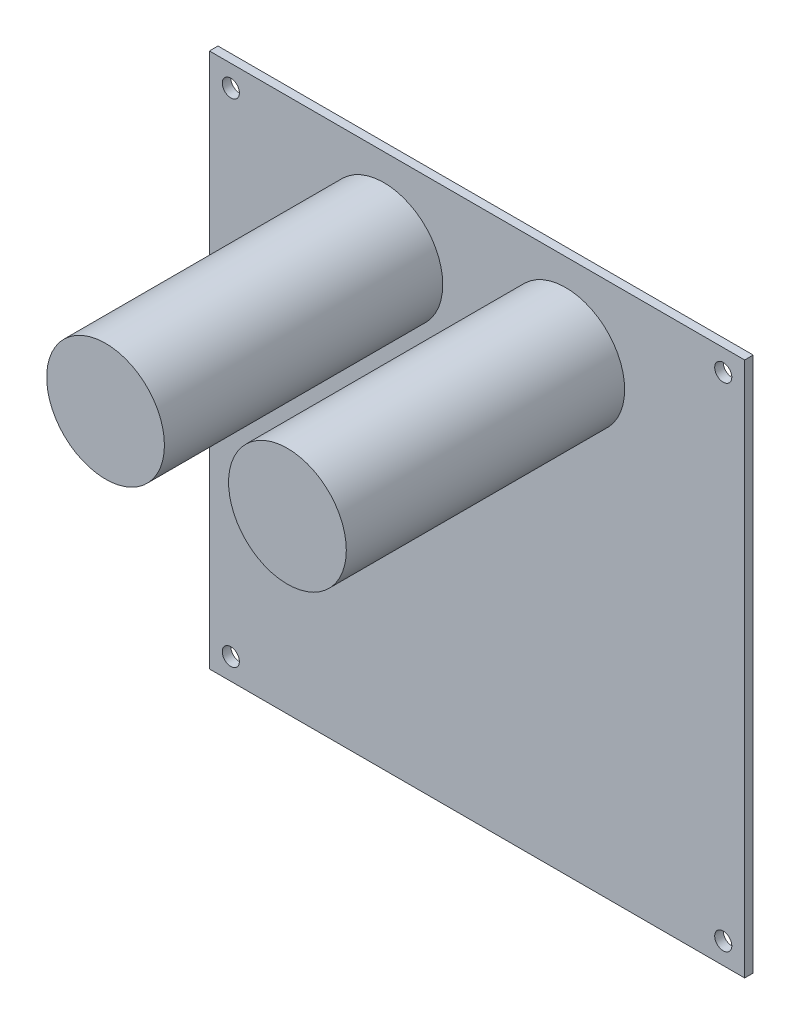
ISO-10303-21;
HEADER;
FILE_DESCRIPTION(('STEP AP214'),'2;1');
FILE_NAME('part.step','',(''),(''),'','','');
FILE_SCHEMA(('AUTOMOTIVE_DESIGN { 1 0 10303 214 1 1 1 1 }'));
ENDSEC;
DATA;
#1=APPLICATION_CONTEXT('core data for automotive mechanical design processes');
#2=APPLICATION_PROTOCOL_DEFINITION('international standard','automotive_design',2000,#1);
#3=PRODUCT_CONTEXT('',#1,'mechanical');
#4=PRODUCT('Part','Part','',(#3));
#5=PRODUCT_RELATED_PRODUCT_CATEGORY('part','',(#4));
#6=PRODUCT_DEFINITION_FORMATION('','',#4);
#7=PRODUCT_DEFINITION_CONTEXT('part definition',#1,'design');
#8=PRODUCT_DEFINITION('design','',#6,#7);
#9=PRODUCT_DEFINITION_SHAPE('','',#8);
#10=(LENGTH_UNIT() NAMED_UNIT(*) SI_UNIT(.MILLI.,.METRE.));
#11=(NAMED_UNIT(*) PLANE_ANGLE_UNIT() SI_UNIT($,.RADIAN.));
#12=(NAMED_UNIT(*) SI_UNIT($,.STERADIAN.) SOLID_ANGLE_UNIT());
#13=UNCERTAINTY_MEASURE_WITH_UNIT(LENGTH_MEASURE(1.E-05),#10,'distance_accuracy_value','');
#14=(GEOMETRIC_REPRESENTATION_CONTEXT(3) GLOBAL_UNCERTAINTY_ASSIGNED_CONTEXT((#13)) GLOBAL_UNIT_ASSIGNED_CONTEXT((#10,
#11,#12)) REPRESENTATION_CONTEXT('',''));
#15=CARTESIAN_POINT('',(0.,0.,0.));
#16=DIRECTION('',(0.,0.,1.));
#17=DIRECTION('',(1.,0.,0.));
#18=AXIS2_PLACEMENT_3D('',#15,#16,#17);
#19=CARTESIAN_POINT('',(0.,0.,1.6));
#20=DIRECTION('',(0.,0.,1.));
#21=DIRECTION('',(1.,0.,0.));
#22=AXIS2_PLACEMENT_3D('',#19,#20,#21);
#23=PLANE('',#22);
#24=CARTESIAN_POINT('',(16.5773981033368,34.,1.6));
#25=DIRECTION('',(0.,0.,1.));
#26=DIRECTION('',(1.,0.,0.));
#27=AXIS2_PLACEMENT_3D('',#24,#25,#26);
#28=CIRCLE('',#27,11.);
#29=CARTESIAN_POINT('',(27.5773981033368,34.,1.6));
#30=VERTEX_POINT('',#29);
#31=EDGE_CURVE('E142',#30,#30,#28,.T.);
#32=ORIENTED_EDGE('',*,*,#31,.F.);
#33=EDGE_LOOP('',(#32));
#34=FACE_BOUND('',#33,.T.);
#35=CARTESIAN_POINT('',(-17.405055540582,34.,1.6));
#36=DIRECTION('',(0.,0.,1.));
#37=DIRECTION('',(1.,0.,0.));
#38=AXIS2_PLACEMENT_3D('',#35,#36,#37);
#39=CIRCLE('',#38,11.);
#40=CARTESIAN_POINT('',(-6.40505554058203,34.,1.6));
#41=VERTEX_POINT('',#40);
#42=EDGE_CURVE('E136',#41,#41,#39,.T.);
#43=ORIENTED_EDGE('',*,*,#42,.F.);
#44=EDGE_LOOP('',(#43));
#45=FACE_BOUND('',#44,.T.);
#46=CARTESIAN_POINT('',(-46.,-46.,1.6));
#47=DIRECTION('',(0.,0.,1.));
#48=DIRECTION('',(1.,0.,0.));
#49=AXIS2_PLACEMENT_3D('',#46,#47,#48);
#50=CIRCLE('',#49,1.6);
#51=CARTESIAN_POINT('',(-44.4,-46.,1.6));
#52=VERTEX_POINT('',#51);
#53=EDGE_CURVE('E121',#52,#52,#50,.T.);
#54=ORIENTED_EDGE('',*,*,#53,.F.);
#55=EDGE_LOOP('',(#54));
#56=FACE_BOUND('',#55,.T.);
#57=CARTESIAN_POINT('',(-46.,46.,1.6));
#58=DIRECTION('',(0.,0.,1.));
#59=DIRECTION('',(1.,0.,0.));
#60=AXIS2_PLACEMENT_3D('',#57,#58,#59);
#61=CIRCLE('',#60,1.6);
#62=CARTESIAN_POINT('',(-44.4,46.,1.6));
#63=VERTEX_POINT('',#62);
#64=EDGE_CURVE('E100',#63,#63,#61,.T.);
#65=ORIENTED_EDGE('',*,*,#64,.F.);
#66=EDGE_LOOP('',(#65));
#67=FACE_BOUND('',#66,.T.);
#68=DIRECTION('',(0.,-1.,0.));
#69=VECTOR('',#68,1.);
#70=CARTESIAN_POINT('',(-50.,50.,1.6));
#71=LINE('',#70,#69);
#72=CARTESIAN_POINT('',(-50.,50.,1.6));
#73=VERTEX_POINT('',#72);
#74=CARTESIAN_POINT('',(-50.,-50.,1.6));
#75=VERTEX_POINT('',#74);
#76=EDGE_CURVE('E85',#73,#75,#71,.T.);
#77=ORIENTED_EDGE('',*,*,#76,.T.);
#78=DIRECTION('',(1.,0.,0.));
#79=VECTOR('',#78,1.);
#80=CARTESIAN_POINT('',(-50.,-50.,1.6));
#81=LINE('',#80,#79);
#82=CARTESIAN_POINT('',(50.,-50.,1.6));
#83=VERTEX_POINT('',#82);
#84=EDGE_CURVE('E80',#75,#83,#81,.T.);
#85=ORIENTED_EDGE('',*,*,#84,.T.);
#86=DIRECTION('',(0.,1.,0.));
#87=VECTOR('',#86,1.);
#88=CARTESIAN_POINT('',(50.,50.,1.6));
#89=LINE('',#88,#87);
#90=CARTESIAN_POINT('',(50.,50.,1.6));
#91=VERTEX_POINT('',#90);
#92=EDGE_CURVE('E83',#83,#91,#89,.T.);
#93=ORIENTED_EDGE('',*,*,#92,.T.);
#94=DIRECTION('',(-1.,0.,0.));
#95=VECTOR('',#94,1.);
#96=CARTESIAN_POINT('',(-50.,50.,1.6));
#97=LINE('',#96,#95);
#98=EDGE_CURVE('E50',#91,#73,#97,.T.);
#99=ORIENTED_EDGE('',*,*,#98,.T.);
#100=EDGE_LOOP('',(#77,#85,#93,#99));
#101=FACE_BOUND('',#100,.T.);
#102=CARTESIAN_POINT('',(46.,46.,1.6));
#103=DIRECTION('',(0.,0.,1.));
#104=DIRECTION('',(1.,0.,0.));
#105=AXIS2_PLACEMENT_3D('',#102,#103,#104);
#106=CIRCLE('',#105,1.6);
#107=CARTESIAN_POINT('',(47.6,46.,1.6));
#108=VERTEX_POINT('',#107);
#109=EDGE_CURVE('E115',#108,#108,#106,.T.);
#110=ORIENTED_EDGE('',*,*,#109,.F.);
#111=EDGE_LOOP('',(#110));
#112=FACE_BOUND('',#111,.T.);
#113=CARTESIAN_POINT('',(46.,-46.,1.6));
#114=DIRECTION('',(0.,0.,1.));
#115=DIRECTION('',(1.,0.,0.));
#116=AXIS2_PLACEMENT_3D('',#113,#114,#115);
#117=CIRCLE('',#116,1.6);
#118=CARTESIAN_POINT('',(47.6,-46.,1.6));
#119=VERTEX_POINT('',#118);
#120=EDGE_CURVE('E127',#119,#119,#117,.T.);
#121=ORIENTED_EDGE('',*,*,#120,.F.);
#122=EDGE_LOOP('',(#121));
#123=FACE_BOUND('',#122,.T.);
#124=ADVANCED_FACE('F33',(#34,#45,#56,#67,#101,#112,#123),#23,.T.);
#125=CARTESIAN_POINT('',(0.,0.,0.));
#126=DIRECTION('',(0.,0.,1.));
#127=DIRECTION('',(1.,0.,0.));
#128=AXIS2_PLACEMENT_3D('',#125,#126,#127);
#129=PLANE('',#128);
#130=DIRECTION('',(0.,-1.,0.));
#131=VECTOR('',#130,1.);
#132=CARTESIAN_POINT('',(-50.,50.,0.));
#133=LINE('',#132,#131);
#134=CARTESIAN_POINT('',(-50.,50.,0.));
#135=VERTEX_POINT('',#134);
#136=CARTESIAN_POINT('',(-50.,-50.,0.));
#137=VERTEX_POINT('',#136);
#138=EDGE_CURVE('E97',#135,#137,#133,.T.);
#139=ORIENTED_EDGE('',*,*,#138,.F.);
#140=DIRECTION('',(-1.,0.,0.));
#141=VECTOR('',#140,1.);
#142=CARTESIAN_POINT('',(-50.,50.,0.));
#143=LINE('',#142,#141);
#144=CARTESIAN_POINT('',(50.,50.,0.));
#145=VERTEX_POINT('',#144);
#146=EDGE_CURVE('E73',#145,#135,#143,.T.);
#147=ORIENTED_EDGE('',*,*,#146,.F.);
#148=DIRECTION('',(0.,1.,0.));
#149=VECTOR('',#148,1.);
#150=CARTESIAN_POINT('',(50.,50.,0.));
#151=LINE('',#150,#149);
#152=CARTESIAN_POINT('',(50.,-50.,0.));
#153=VERTEX_POINT('',#152);
#154=EDGE_CURVE('E67',#153,#145,#151,.T.);
#155=ORIENTED_EDGE('',*,*,#154,.F.);
#156=DIRECTION('',(1.,0.,0.));
#157=VECTOR('',#156,1.);
#158=CARTESIAN_POINT('',(-50.,-50.,0.));
#159=LINE('',#158,#157);
#160=EDGE_CURVE('E89',#137,#153,#159,.T.);
#161=ORIENTED_EDGE('',*,*,#160,.F.);
#162=EDGE_LOOP('',(#139,#147,#155,#161));
#163=FACE_BOUND('',#162,.T.);
#164=CARTESIAN_POINT('',(-46.,46.,0.));
#165=DIRECTION('',(0.,0.,1.));
#166=DIRECTION('',(1.,0.,0.));
#167=AXIS2_PLACEMENT_3D('',#164,#165,#166);
#168=CIRCLE('',#167,1.6);
#169=CARTESIAN_POINT('',(-44.4,46.,0.));
#170=VERTEX_POINT('',#169);
#171=EDGE_CURVE('E112',#170,#170,#168,.T.);
#172=ORIENTED_EDGE('',*,*,#171,.T.);
#173=EDGE_LOOP('',(#172));
#174=FACE_BOUND('',#173,.T.);
#175=CARTESIAN_POINT('',(46.,46.,0.));
#176=DIRECTION('',(0.,0.,1.));
#177=DIRECTION('',(1.,0.,0.));
#178=AXIS2_PLACEMENT_3D('',#175,#176,#177);
#179=CIRCLE('',#178,1.6);
#180=CARTESIAN_POINT('',(47.6,46.,0.));
#181=VERTEX_POINT('',#180);
#182=EDGE_CURVE('E118',#181,#181,#179,.T.);
#183=ORIENTED_EDGE('',*,*,#182,.T.);
#184=EDGE_LOOP('',(#183));
#185=FACE_BOUND('',#184,.T.);
#186=CARTESIAN_POINT('',(-46.,-46.,0.));
#187=DIRECTION('',(0.,0.,1.));
#188=DIRECTION('',(1.,0.,0.));
#189=AXIS2_PLACEMENT_3D('',#186,#187,#188);
#190=CIRCLE('',#189,1.6);
#191=CARTESIAN_POINT('',(-44.4,-46.,0.));
#192=VERTEX_POINT('',#191);
#193=EDGE_CURVE('E124',#192,#192,#190,.T.);
#194=ORIENTED_EDGE('',*,*,#193,.T.);
#195=EDGE_LOOP('',(#194));
#196=FACE_BOUND('',#195,.T.);
#197=CARTESIAN_POINT('',(46.,-46.,0.));
#198=DIRECTION('',(0.,0.,1.));
#199=DIRECTION('',(1.,0.,0.));
#200=AXIS2_PLACEMENT_3D('',#197,#198,#199);
#201=CIRCLE('',#200,1.6);
#202=CARTESIAN_POINT('',(47.6,-46.,0.));
#203=VERTEX_POINT('',#202);
#204=EDGE_CURVE('E130',#203,#203,#201,.T.);
#205=ORIENTED_EDGE('',*,*,#204,.T.);
#206=EDGE_LOOP('',(#205));
#207=FACE_BOUND('',#206,.T.);
#208=ADVANCED_FACE('F108',(#163,#174,#185,#196,#207),#129,.F.);
#209=CARTESIAN_POINT('',(-50.,50.,1.6));
#210=DIRECTION('',(1.,0.,0.));
#211=DIRECTION('',(0.,1.,0.));
#212=AXIS2_PLACEMENT_3D('',#209,#210,#211);
#213=PLANE('',#212);
#214=ORIENTED_EDGE('',*,*,#138,.T.);
#215=DIRECTION('',(0.,0.,-1.));
#216=VECTOR('',#215,1.);
#217=CARTESIAN_POINT('',(-50.,-50.,1.6));
#218=LINE('',#217,#216);
#219=EDGE_CURVE('E11',#75,#137,#218,.T.);
#220=ORIENTED_EDGE('',*,*,#219,.F.);
#221=ORIENTED_EDGE('',*,*,#76,.F.);
#222=DIRECTION('',(0.,0.,-1.));
#223=VECTOR('',#222,1.);
#224=CARTESIAN_POINT('',(-50.,50.,1.6));
#225=LINE('',#224,#223);
#226=EDGE_CURVE('E93',#73,#135,#225,.T.);
#227=ORIENTED_EDGE('',*,*,#226,.T.);
#228=EDGE_LOOP('',(#214,#220,#221,#227));
#229=FACE_BOUND('',#228,.T.);
#230=ADVANCED_FACE('F35',(#229),#213,.F.);
#231=CARTESIAN_POINT('',(-50.,-50.,1.6));
#232=DIRECTION('',(0.,1.,0.));
#233=DIRECTION('',(0.,0.,1.));
#234=AXIS2_PLACEMENT_3D('',#231,#232,#233);
#235=PLANE('',#234);
#236=ORIENTED_EDGE('',*,*,#160,.T.);
#237=DIRECTION('',(0.,0.,-1.));
#238=VECTOR('',#237,1.);
#239=CARTESIAN_POINT('',(50.,-50.,1.6));
#240=LINE('',#239,#238);
#241=EDGE_CURVE('E42',#83,#153,#240,.T.);
#242=ORIENTED_EDGE('',*,*,#241,.F.);
#243=ORIENTED_EDGE('',*,*,#84,.F.);
#244=ORIENTED_EDGE('',*,*,#219,.T.);
#245=EDGE_LOOP('',(#236,#242,#243,#244));
#246=FACE_BOUND('',#245,.T.);
#247=ADVANCED_FACE('F88',(#246),#235,.F.);
#248=CARTESIAN_POINT('',(50.,50.,1.6));
#249=DIRECTION('',(-1.,0.,0.));
#250=DIRECTION('',(0.,0.,1.));
#251=AXIS2_PLACEMENT_3D('',#248,#249,#250);
#252=PLANE('',#251);
#253=ORIENTED_EDGE('',*,*,#154,.T.);
#254=DIRECTION('',(0.,0.,-1.));
#255=VECTOR('',#254,1.);
#256=CARTESIAN_POINT('',(50.,50.,1.6));
#257=LINE('',#256,#255);
#258=EDGE_CURVE('E90',#91,#145,#257,.T.);
#259=ORIENTED_EDGE('',*,*,#258,.F.);
#260=ORIENTED_EDGE('',*,*,#92,.F.);
#261=ORIENTED_EDGE('',*,*,#241,.T.);
#262=EDGE_LOOP('',(#253,#259,#260,#261));
#263=FACE_BOUND('',#262,.T.);
#264=ADVANCED_FACE('F91',(#263),#252,.F.);
#265=CARTESIAN_POINT('',(-50.,50.,1.6));
#266=DIRECTION('',(0.,-1.,0.));
#267=DIRECTION('',(0.,0.,-1.));
#268=AXIS2_PLACEMENT_3D('',#265,#266,#267);
#269=PLANE('',#268);
#270=ORIENTED_EDGE('',*,*,#146,.T.);
#271=ORIENTED_EDGE('',*,*,#226,.F.);
#272=ORIENTED_EDGE('',*,*,#98,.F.);
#273=ORIENTED_EDGE('',*,*,#258,.T.);
#274=EDGE_LOOP('',(#270,#271,#272,#273));
#275=FACE_BOUND('',#274,.T.);
#276=ADVANCED_FACE('F105',(#275),#269,.F.);
#277=CARTESIAN_POINT('',(-46.,46.,1.6));
#278=DIRECTION('',(0.,0.,-1.));
#279=DIRECTION('',(-1.,0.,0.));
#280=AXIS2_PLACEMENT_3D('',#277,#278,#279);
#281=CYLINDRICAL_SURFACE('',#280,1.6);
#282=ORIENTED_EDGE('',*,*,#64,.T.);
#283=EDGE_LOOP('',(#282));
#284=FACE_BOUND('',#283,.T.);
#285=ORIENTED_EDGE('',*,*,#171,.F.);
#286=EDGE_LOOP('',(#285));
#287=FACE_BOUND('',#286,.T.);
#288=ADVANCED_FACE('F166',(#284,#287),#281,.F.);
#289=CARTESIAN_POINT('',(46.,46.,1.6));
#290=DIRECTION('',(0.,0.,-1.));
#291=DIRECTION('',(-1.,0.,0.));
#292=AXIS2_PLACEMENT_3D('',#289,#290,#291);
#293=CYLINDRICAL_SURFACE('',#292,1.6);
#294=ORIENTED_EDGE('',*,*,#109,.T.);
#295=EDGE_LOOP('',(#294));
#296=FACE_BOUND('',#295,.T.);
#297=ORIENTED_EDGE('',*,*,#182,.F.);
#298=EDGE_LOOP('',(#297));
#299=FACE_BOUND('',#298,.T.);
#300=ADVANCED_FACE('F169',(#296,#299),#293,.F.);
#301=CARTESIAN_POINT('',(-46.,-46.,1.6));
#302=DIRECTION('',(0.,0.,-1.));
#303=DIRECTION('',(-1.,0.,0.));
#304=AXIS2_PLACEMENT_3D('',#301,#302,#303);
#305=CYLINDRICAL_SURFACE('',#304,1.6);
#306=ORIENTED_EDGE('',*,*,#53,.T.);
#307=EDGE_LOOP('',(#306));
#308=FACE_BOUND('',#307,.T.);
#309=ORIENTED_EDGE('',*,*,#193,.F.);
#310=EDGE_LOOP('',(#309));
#311=FACE_BOUND('',#310,.T.);
#312=ADVANCED_FACE('F184',(#308,#311),#305,.F.);
#313=CARTESIAN_POINT('',(46.,-46.,1.6));
#314=DIRECTION('',(0.,0.,-1.));
#315=DIRECTION('',(-1.,0.,0.));
#316=AXIS2_PLACEMENT_3D('',#313,#314,#315);
#317=CYLINDRICAL_SURFACE('',#316,1.6);
#318=ORIENTED_EDGE('',*,*,#120,.T.);
#319=EDGE_LOOP('',(#318));
#320=FACE_BOUND('',#319,.T.);
#321=ORIENTED_EDGE('',*,*,#204,.F.);
#322=EDGE_LOOP('',(#321));
#323=FACE_BOUND('',#322,.T.);
#324=ADVANCED_FACE('F181',(#320,#323),#317,.F.);
#325=CARTESIAN_POINT('',(-17.405055540582,34.,53.6));
#326=DIRECTION('',(0.,0.,-1.));
#327=DIRECTION('',(-1.,0.,0.));
#328=AXIS2_PLACEMENT_3D('',#325,#326,#327);
#329=CYLINDRICAL_SURFACE('',#328,11.);
#330=CARTESIAN_POINT('',(-17.405055540582,34.,53.6));
#331=DIRECTION('',(0.,0.,1.));
#332=DIRECTION('',(1.,0.,0.));
#333=AXIS2_PLACEMENT_3D('',#330,#331,#332);
#334=CIRCLE('',#333,11.);
#335=CARTESIAN_POINT('',(-6.40505554058203,34.,53.6));
#336=VERTEX_POINT('',#335);
#337=EDGE_CURVE('E133',#336,#336,#334,.T.);
#338=ORIENTED_EDGE('',*,*,#337,.F.);
#339=EDGE_LOOP('',(#338));
#340=FACE_BOUND('',#339,.T.);
#341=ORIENTED_EDGE('',*,*,#42,.T.);
#342=EDGE_LOOP('',(#341));
#343=FACE_BOUND('',#342,.T.);
#344=ADVANCED_FACE('F183',(#340,#343),#329,.T.);
#345=CARTESIAN_POINT('',(-17.405055540582,34.,53.6));
#346=DIRECTION('',(0.,0.,1.));
#347=DIRECTION('',(1.,0.,0.));
#348=AXIS2_PLACEMENT_3D('',#345,#346,#347);
#349=PLANE('',#348);
#350=ORIENTED_EDGE('',*,*,#337,.T.);
#351=EDGE_LOOP('',(#350));
#352=FACE_BOUND('',#351,.T.);
#353=ADVANCED_FACE('F153',(#352),#349,.T.);
#354=CARTESIAN_POINT('',(16.5773981033368,34.,53.6));
#355=DIRECTION('',(0.,0.,-1.));
#356=DIRECTION('',(-1.,0.,0.));
#357=AXIS2_PLACEMENT_3D('',#354,#355,#356);
#358=CYLINDRICAL_SURFACE('',#357,11.);
#359=CARTESIAN_POINT('',(16.5773981033368,34.,53.6));
#360=DIRECTION('',(0.,0.,1.));
#361=DIRECTION('',(1.,0.,0.));
#362=AXIS2_PLACEMENT_3D('',#359,#360,#361);
#363=CIRCLE('',#362,11.);
#364=CARTESIAN_POINT('',(27.5773981033368,34.,53.6));
#365=VERTEX_POINT('',#364);
#366=EDGE_CURVE('E139',#365,#365,#363,.T.);
#367=ORIENTED_EDGE('',*,*,#366,.F.);
#368=EDGE_LOOP('',(#367));
#369=FACE_BOUND('',#368,.T.);
#370=ORIENTED_EDGE('',*,*,#31,.T.);
#371=EDGE_LOOP('',(#370));
#372=FACE_BOUND('',#371,.T.);
#373=ADVANCED_FACE('F150',(#369,#372),#358,.T.);
#374=CARTESIAN_POINT('',(16.5773981033368,34.,53.6));
#375=DIRECTION('',(0.,0.,1.));
#376=DIRECTION('',(1.,0.,0.));
#377=AXIS2_PLACEMENT_3D('',#374,#375,#376);
#378=PLANE('',#377);
#379=ORIENTED_EDGE('',*,*,#366,.T.);
#380=EDGE_LOOP('',(#379));
#381=FACE_BOUND('',#380,.T.);
#382=ADVANCED_FACE('F148',(#381),#378,.T.);
#383=CLOSED_SHELL('',(#124,#208,#230,#247,#264,#276,#288,#300,#312,#324,#344,#353,#373,#382));
#384=MANIFOLD_SOLID_BREP('B2',#383);
#385=ADVANCED_BREP_SHAPE_REPRESENTATION('',(#18,#384),#14);
#386=SHAPE_DEFINITION_REPRESENTATION(#9,#385);
ENDSEC;
END-ISO-10303-21;
